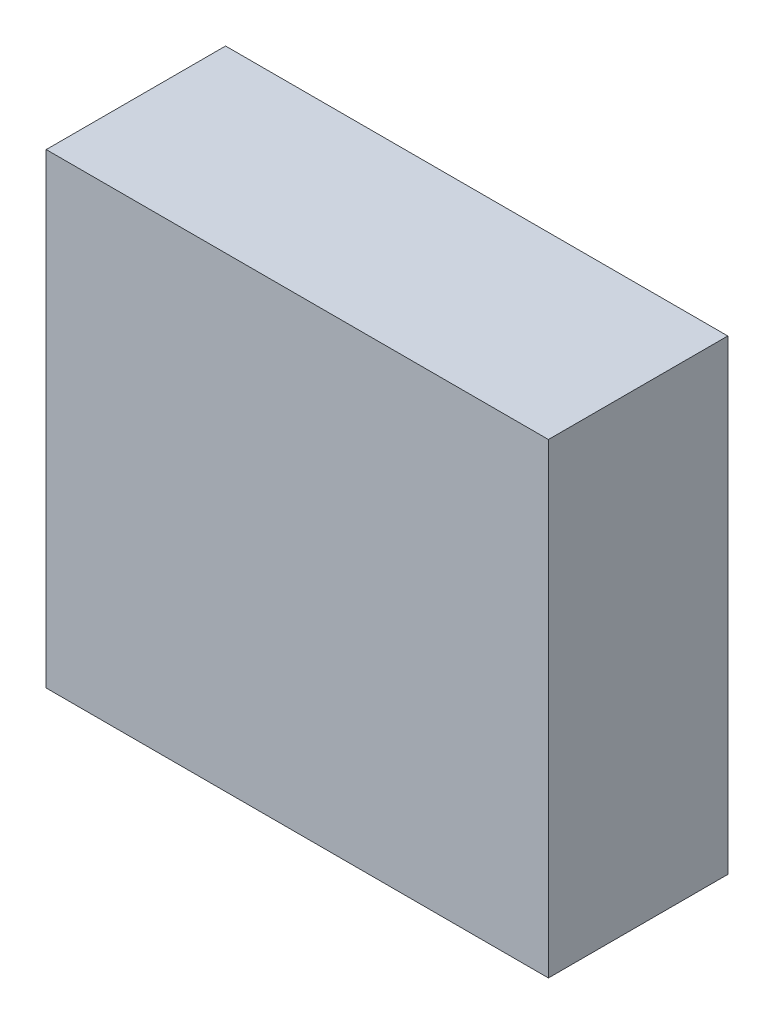
ISO-10303-21;
HEADER;
FILE_DESCRIPTION(('STEP AP214'),'2;1');
FILE_NAME('part.step','',(''),(''),'','','');
FILE_SCHEMA(('AUTOMOTIVE_DESIGN { 1 0 10303 214 1 1 1 1 }'));
ENDSEC;
DATA;
#1=APPLICATION_CONTEXT('core data for automotive mechanical design processes');
#2=APPLICATION_PROTOCOL_DEFINITION('international standard','automotive_design',2000,#1);
#3=PRODUCT_CONTEXT('',#1,'mechanical');
#4=PRODUCT('Part','Part','',(#3));
#5=PRODUCT_RELATED_PRODUCT_CATEGORY('part','',(#4));
#6=PRODUCT_DEFINITION_FORMATION('','',#4);
#7=PRODUCT_DEFINITION_CONTEXT('part definition',#1,'design');
#8=PRODUCT_DEFINITION('design','',#6,#7);
#9=PRODUCT_DEFINITION_SHAPE('','',#8);
#10=(LENGTH_UNIT() NAMED_UNIT(*) SI_UNIT(.MILLI.,.METRE.));
#11=(NAMED_UNIT(*) PLANE_ANGLE_UNIT() SI_UNIT($,.RADIAN.));
#12=(NAMED_UNIT(*) SI_UNIT($,.STERADIAN.) SOLID_ANGLE_UNIT());
#13=UNCERTAINTY_MEASURE_WITH_UNIT(LENGTH_MEASURE(1.E-05),#10,'distance_accuracy_value','');
#14=(GEOMETRIC_REPRESENTATION_CONTEXT(3) GLOBAL_UNCERTAINTY_ASSIGNED_CONTEXT((#13)) GLOBAL_UNIT_ASSIGNED_CONTEXT((#10,
#11,#12)) REPRESENTATION_CONTEXT('',''));
#15=CARTESIAN_POINT('',(0.,0.,0.));
#16=DIRECTION('',(0.,0.,1.));
#17=DIRECTION('',(1.,0.,0.));
#18=AXIS2_PLACEMENT_3D('',#15,#16,#17);
#19=CARTESIAN_POINT('',(35.,32.5,25.));
#20=DIRECTION('',(-1.,0.,0.));
#21=DIRECTION('',(0.,-1.,0.));
#22=AXIS2_PLACEMENT_3D('',#19,#20,#21);
#23=PLANE('',#22);
#24=DIRECTION('',(0.,1.,0.));
#25=VECTOR('',#24,1.);
#26=CARTESIAN_POINT('',(35.,32.5,0.));
#27=LINE('',#26,#25);
#28=CARTESIAN_POINT('',(35.,-32.5,0.));
#29=VERTEX_POINT('',#28);
#30=CARTESIAN_POINT('',(35.,32.5,0.));
#31=VERTEX_POINT('',#30);
#32=EDGE_CURVE('E98',#29,#31,#27,.T.);
#33=ORIENTED_EDGE('',*,*,#32,.T.);
#34=DIRECTION('',(0.,0.,-1.));
#35=VECTOR('',#34,1.);
#36=CARTESIAN_POINT('',(35.,32.5,25.));
#37=LINE('',#36,#35);
#38=CARTESIAN_POINT('',(35.,32.5,25.));
#39=VERTEX_POINT('',#38);
#40=EDGE_CURVE('E11',#39,#31,#37,.T.);
#41=ORIENTED_EDGE('',*,*,#40,.F.);
#42=DIRECTION('',(0.,1.,0.));
#43=VECTOR('',#42,1.);
#44=CARTESIAN_POINT('',(35.,32.5,25.));
#45=LINE('',#44,#43);
#46=CARTESIAN_POINT('',(35.,-32.5,25.));
#47=VERTEX_POINT('',#46);
#48=EDGE_CURVE('E86',#47,#39,#45,.T.);
#49=ORIENTED_EDGE('',*,*,#48,.F.);
#50=DIRECTION('',(0.,0.,-1.));
#51=VECTOR('',#50,1.);
#52=CARTESIAN_POINT('',(35.,-32.5,25.));
#53=LINE('',#52,#51);
#54=EDGE_CURVE('E94',#47,#29,#53,.T.);
#55=ORIENTED_EDGE('',*,*,#54,.T.);
#56=EDGE_LOOP('',(#33,#41,#49,#55));
#57=FACE_BOUND('',#56,.T.);
#58=ADVANCED_FACE('F35',(#57),#23,.F.);
#59=CARTESIAN_POINT('',(-35.,32.5,25.));
#60=DIRECTION('',(0.,-1.,0.));
#61=DIRECTION('',(0.,0.,-1.));
#62=AXIS2_PLACEMENT_3D('',#59,#60,#61);
#63=PLANE('',#62);
#64=DIRECTION('',(-1.,0.,0.));
#65=VECTOR('',#64,1.);
#66=CARTESIAN_POINT('',(-35.,32.5,0.));
#67=LINE('',#66,#65);
#68=CARTESIAN_POINT('',(-35.,32.5,0.));
#69=VERTEX_POINT('',#68);
#70=EDGE_CURVE('E90',#31,#69,#67,.T.);
#71=ORIENTED_EDGE('',*,*,#70,.T.);
#72=DIRECTION('',(0.,0.,-1.));
#73=VECTOR('',#72,1.);
#74=CARTESIAN_POINT('',(-35.,32.5,25.));
#75=LINE('',#74,#73);
#76=CARTESIAN_POINT('',(-35.,32.5,25.));
#77=VERTEX_POINT('',#76);
#78=EDGE_CURVE('E43',#77,#69,#75,.T.);
#79=ORIENTED_EDGE('',*,*,#78,.F.);
#80=DIRECTION('',(-1.,0.,0.));
#81=VECTOR('',#80,1.);
#82=CARTESIAN_POINT('',(-35.,32.5,25.));
#83=LINE('',#82,#81);
#84=EDGE_CURVE('E81',#39,#77,#83,.T.);
#85=ORIENTED_EDGE('',*,*,#84,.F.);
#86=ORIENTED_EDGE('',*,*,#40,.T.);
#87=EDGE_LOOP('',(#71,#79,#85,#86));
#88=FACE_BOUND('',#87,.T.);
#89=ADVANCED_FACE('F89',(#88),#63,.F.);
#90=CARTESIAN_POINT('',(-35.,32.5,25.));
#91=DIRECTION('',(1.,0.,0.));
#92=DIRECTION('',(0.,1.,0.));
#93=AXIS2_PLACEMENT_3D('',#90,#91,#92);
#94=PLANE('',#93);
#95=DIRECTION('',(0.,-1.,0.));
#96=VECTOR('',#95,1.);
#97=CARTESIAN_POINT('',(-35.,32.5,0.));
#98=LINE('',#97,#96);
#99=CARTESIAN_POINT('',(-35.,-32.5,0.));
#100=VERTEX_POINT('',#99);
#101=EDGE_CURVE('E68',#69,#100,#98,.T.);
#102=ORIENTED_EDGE('',*,*,#101,.T.);
#103=DIRECTION('',(0.,0.,-1.));
#104=VECTOR('',#103,1.);
#105=CARTESIAN_POINT('',(-35.,-32.5,25.));
#106=LINE('',#105,#104);
#107=CARTESIAN_POINT('',(-35.,-32.5,25.));
#108=VERTEX_POINT('',#107);
#109=EDGE_CURVE('E91',#108,#100,#106,.T.);
#110=ORIENTED_EDGE('',*,*,#109,.F.);
#111=DIRECTION('',(0.,-1.,0.));
#112=VECTOR('',#111,1.);
#113=CARTESIAN_POINT('',(-35.,32.5,25.));
#114=LINE('',#113,#112);
#115=EDGE_CURVE('E84',#77,#108,#114,.T.);
#116=ORIENTED_EDGE('',*,*,#115,.F.);
#117=ORIENTED_EDGE('',*,*,#78,.T.);
#118=EDGE_LOOP('',(#102,#110,#116,#117));
#119=FACE_BOUND('',#118,.T.);
#120=ADVANCED_FACE('F92',(#119),#94,.F.);
#121=CARTESIAN_POINT('',(-35.,-32.5,25.));
#122=DIRECTION('',(0.,1.,0.));
#123=DIRECTION('',(0.,0.,1.));
#124=AXIS2_PLACEMENT_3D('',#121,#122,#123);
#125=PLANE('',#124);
#126=DIRECTION('',(1.,0.,0.));
#127=VECTOR('',#126,1.);
#128=CARTESIAN_POINT('',(-35.,-32.5,0.));
#129=LINE('',#128,#127);
#130=EDGE_CURVE('E74',#100,#29,#129,.T.);
#131=ORIENTED_EDGE('',*,*,#130,.T.);
#132=ORIENTED_EDGE('',*,*,#54,.F.);
#133=DIRECTION('',(1.,0.,0.));
#134=VECTOR('',#133,1.);
#135=CARTESIAN_POINT('',(-35.,-32.5,25.));
#136=LINE('',#135,#134);
#137=EDGE_CURVE('E51',#108,#47,#136,.T.);
#138=ORIENTED_EDGE('',*,*,#137,.F.);
#139=ORIENTED_EDGE('',*,*,#109,.T.);
#140=EDGE_LOOP('',(#131,#132,#138,#139));
#141=FACE_BOUND('',#140,.T.);
#142=ADVANCED_FACE('F105',(#141),#125,.F.);
#143=CARTESIAN_POINT('',(0.,0.,25.));
#144=DIRECTION('',(0.,0.,1.));
#145=DIRECTION('',(1.,0.,0.));
#146=AXIS2_PLACEMENT_3D('',#143,#144,#145);
#147=PLANE('',#146);
#148=ORIENTED_EDGE('',*,*,#48,.T.);
#149=ORIENTED_EDGE('',*,*,#84,.T.);
#150=ORIENTED_EDGE('',*,*,#115,.T.);
#151=ORIENTED_EDGE('',*,*,#137,.T.);
#152=EDGE_LOOP('',(#148,#149,#150,#151));
#153=FACE_BOUND('',#152,.T.);
#154=ADVANCED_FACE('F82',(#153),#147,.T.);
#155=CARTESIAN_POINT('',(0.,0.,0.));
#156=DIRECTION('',(0.,0.,1.));
#157=DIRECTION('',(1.,0.,0.));
#158=AXIS2_PLACEMENT_3D('',#155,#156,#157);
#159=PLANE('',#158);
#160=ORIENTED_EDGE('',*,*,#32,.F.);
#161=ORIENTED_EDGE('',*,*,#130,.F.);
#162=ORIENTED_EDGE('',*,*,#101,.F.);
#163=ORIENTED_EDGE('',*,*,#70,.F.);
#164=EDGE_LOOP('',(#160,#161,#162,#163));
#165=FACE_BOUND('',#164,.T.);
#166=ADVANCED_FACE('F108',(#165),#159,.F.);
#167=CLOSED_SHELL('',(#58,#89,#120,#142,#154,#166));
#168=MANIFOLD_SOLID_BREP('B2',#167);
#169=ADVANCED_BREP_SHAPE_REPRESENTATION('',(#18,#168),#14);
#170=SHAPE_DEFINITION_REPRESENTATION(#9,#169);
ENDSEC;
END-ISO-10303-21;
